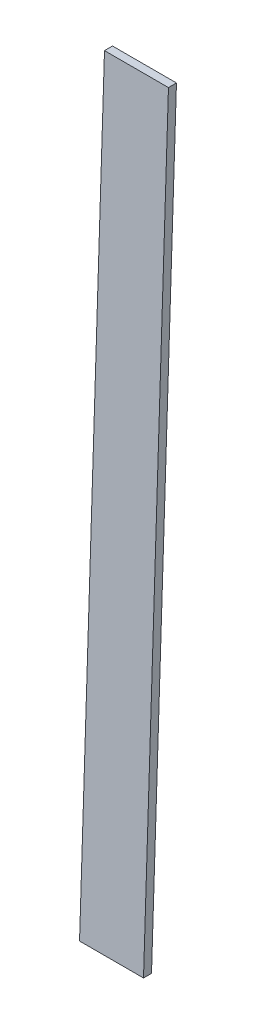
ISO-10303-21;
HEADER;
FILE_DESCRIPTION(('STEP AP214'),'2;1');
FILE_NAME('part.step','',(''),(''),'','','');
FILE_SCHEMA(('AUTOMOTIVE_DESIGN { 1 0 10303 214 1 1 1 1 }'));
ENDSEC;
DATA;
#1=APPLICATION_CONTEXT('core data for automotive mechanical design processes');
#2=APPLICATION_PROTOCOL_DEFINITION('international standard','automotive_design',2000,#1);
#3=PRODUCT_CONTEXT('',#1,'mechanical');
#4=PRODUCT('Part','Part','',(#3));
#5=PRODUCT_RELATED_PRODUCT_CATEGORY('part','',(#4));
#6=PRODUCT_DEFINITION_FORMATION('','',#4);
#7=PRODUCT_DEFINITION_CONTEXT('part definition',#1,'design');
#8=PRODUCT_DEFINITION('design','',#6,#7);
#9=PRODUCT_DEFINITION_SHAPE('','',#8);
#10=(LENGTH_UNIT() NAMED_UNIT(*) SI_UNIT(.MILLI.,.METRE.));
#11=(NAMED_UNIT(*) PLANE_ANGLE_UNIT() SI_UNIT($,.RADIAN.));
#12=(NAMED_UNIT(*) SI_UNIT($,.STERADIAN.) SOLID_ANGLE_UNIT());
#13=UNCERTAINTY_MEASURE_WITH_UNIT(LENGTH_MEASURE(1.E-05),#10,'distance_accuracy_value','');
#14=(GEOMETRIC_REPRESENTATION_CONTEXT(3) GLOBAL_UNCERTAINTY_ASSIGNED_CONTEXT((#13)) GLOBAL_UNIT_ASSIGNED_CONTEXT((#10,
#11,#12)) REPRESENTATION_CONTEXT('',''));
#15=CARTESIAN_POINT('',(0.,0.,0.));
#16=DIRECTION('',(0.,0.,1.));
#17=DIRECTION('',(1.,0.,0.));
#18=AXIS2_PLACEMENT_3D('',#15,#16,#17);
#19=CARTESIAN_POINT('',(0.,0.,0.));
#20=DIRECTION('',(0.,-1.,0.));
#21=DIRECTION('',(0.,0.,-1.));
#22=AXIS2_PLACEMENT_3D('',#19,#20,#21);
#23=PLANE('',#22);
#24=DIRECTION('',(0.,0.,1.));
#25=VECTOR('',#24,1.);
#26=CARTESIAN_POINT('',(0.,0.,0.));
#27=LINE('',#26,#25);
#28=CARTESIAN_POINT('',(0.,0.,-3.175));
#29=VERTEX_POINT('',#28);
#30=CARTESIAN_POINT('',(0.,0.,0.));
#31=VERTEX_POINT('',#30);
#32=EDGE_CURVE('E128',#29,#31,#27,.T.);
#33=ORIENTED_EDGE('',*,*,#32,.F.);
#34=DIRECTION('',(-1.,0.,0.));
#35=VECTOR('',#34,1.);
#36=CARTESIAN_POINT('',(0.,0.,-3.175));
#37=LINE('',#36,#35);
#38=CARTESIAN_POINT('',(25.4,0.,-3.175));
#39=VERTEX_POINT('',#38);
#40=EDGE_CURVE('E125',#39,#29,#37,.T.);
#41=ORIENTED_EDGE('',*,*,#40,.F.);
#42=DIRECTION('',(0.,0.,-1.));
#43=VECTOR('',#42,1.);
#44=CARTESIAN_POINT('',(25.4,0.,0.));
#45=LINE('',#44,#43);
#46=CARTESIAN_POINT('',(25.4,0.,0.));
#47=VERTEX_POINT('',#46);
#48=EDGE_CURVE('E58',#47,#39,#45,.T.);
#49=ORIENTED_EDGE('',*,*,#48,.F.);
#50=DIRECTION('',(1.,0.,0.));
#51=VECTOR('',#50,1.);
#52=CARTESIAN_POINT('',(0.,0.,0.));
#53=LINE('',#52,#51);
#54=EDGE_CURVE('E12',#31,#47,#53,.T.);
#55=ORIENTED_EDGE('',*,*,#54,.F.);
#56=EDGE_LOOP('',(#33,#41,#49,#55));
#57=FACE_BOUND('',#56,.T.);
#58=ADVANCED_FACE('F47',(#57),#23,.T.);
#59=CARTESIAN_POINT('',(0.,301.244,0.));
#60=DIRECTION('',(0.,1.,0.));
#61=DIRECTION('',(0.,0.,1.));
#62=AXIS2_PLACEMENT_3D('',#59,#60,#61);
#63=PLANE('',#62);
#64=DIRECTION('',(0.,0.,1.));
#65=VECTOR('',#64,1.);
#66=CARTESIAN_POINT('',(0.,301.244,-13.081));
#67=LINE('',#66,#65);
#68=CARTESIAN_POINT('',(0.,301.244,-13.081));
#69=VERTEX_POINT('',#68);
#70=CARTESIAN_POINT('',(0.,301.244,-9.906));
#71=VERTEX_POINT('',#70);
#72=EDGE_CURVE('E98',#69,#71,#67,.T.);
#73=ORIENTED_EDGE('',*,*,#72,.T.);
#74=DIRECTION('',(1.,0.,0.));
#75=VECTOR('',#74,1.);
#76=CARTESIAN_POINT('',(0.,301.244,-9.906));
#77=LINE('',#76,#75);
#78=CARTESIAN_POINT('',(25.4,301.244,-9.906));
#79=VERTEX_POINT('',#78);
#80=EDGE_CURVE('E119',#71,#79,#77,.T.);
#81=ORIENTED_EDGE('',*,*,#80,.T.);
#82=DIRECTION('',(0.,0.,-1.));
#83=VECTOR('',#82,1.);
#84=CARTESIAN_POINT('',(25.4,301.244,-13.081));
#85=LINE('',#84,#83);
#86=CARTESIAN_POINT('',(25.4,301.244,-13.081));
#87=VERTEX_POINT('',#86);
#88=EDGE_CURVE('E100',#79,#87,#85,.T.);
#89=ORIENTED_EDGE('',*,*,#88,.T.);
#90=DIRECTION('',(-1.,0.,0.));
#91=VECTOR('',#90,1.);
#92=CARTESIAN_POINT('',(0.,301.244,-13.081));
#93=LINE('',#92,#91);
#94=EDGE_CURVE('E93',#87,#69,#93,.T.);
#95=ORIENTED_EDGE('',*,*,#94,.T.);
#96=EDGE_LOOP('',(#73,#81,#89,#95));
#97=FACE_BOUND('',#96,.T.);
#98=ADVANCED_FACE('F96',(#97),#63,.T.);
#99=CARTESIAN_POINT('',(25.4,0.,0.));
#100=DIRECTION('',(1.,0.,0.));
#101=DIRECTION('',(0.,1.,0.));
#102=AXIS2_PLACEMENT_3D('',#99,#100,#101);
#103=PLANE('',#102);
#104=DIRECTION('',(0.,-0.999459771114519,0.0328658778022481));
#105=VECTOR('',#104,1.);
#106=CARTESIAN_POINT('',(25.4,301.244,-9.906));
#107=LINE('',#106,#105);
#108=EDGE_CURVE('E66',#79,#47,#107,.T.);
#109=ORIENTED_EDGE('',*,*,#108,.T.);
#110=ORIENTED_EDGE('',*,*,#48,.T.);
#111=DIRECTION('',(0.,-0.999459771114519,0.0328658778022481));
#112=VECTOR('',#111,1.);
#113=CARTESIAN_POINT('',(25.4,301.244,-13.081));
#114=LINE('',#113,#112);
#115=EDGE_CURVE('E133',#87,#39,#114,.T.);
#116=ORIENTED_EDGE('',*,*,#115,.F.);
#117=ORIENTED_EDGE('',*,*,#88,.F.);
#118=EDGE_LOOP('',(#109,#110,#116,#117));
#119=FACE_BOUND('',#118,.T.);
#120=ADVANCED_FACE('F147',(#119),#103,.T.);
#121=CARTESIAN_POINT('',(0.,-0.104292789590638,-3.17157047319222));
#122=DIRECTION('',(0.,-0.0328658778022481,-0.99945977111452));
#123=DIRECTION('',(0.,0.999459771114519,-0.0328658778022481));
#124=AXIS2_PLACEMENT_3D('',#121,#122,#123);
#125=PLANE('',#124);
#126=ORIENTED_EDGE('',*,*,#115,.T.);
#127=ORIENTED_EDGE('',*,*,#40,.T.);
#128=DIRECTION('',(0.,-0.999459771114519,0.0328658778022481));
#129=VECTOR('',#128,1.);
#130=CARTESIAN_POINT('',(0.,301.244,-13.081));
#131=LINE('',#130,#129);
#132=EDGE_CURVE('E115',#69,#29,#131,.T.);
#133=ORIENTED_EDGE('',*,*,#132,.F.);
#134=ORIENTED_EDGE('',*,*,#94,.F.);
#135=EDGE_LOOP('',(#126,#127,#133,#134));
#136=FACE_BOUND('',#135,.T.);
#137=ADVANCED_FACE('F123',(#136),#125,.T.);
#138=CARTESIAN_POINT('',(0.,0.,0.));
#139=DIRECTION('',(0.,0.0328658778022481,0.99945977111452));
#140=DIRECTION('',(0.,-0.999459771114519,0.0328658778022481));
#141=AXIS2_PLACEMENT_3D('',#138,#139,#140);
#142=PLANE('',#141);
#143=DIRECTION('',(0.,-0.999459771114519,0.0328658778022481));
#144=VECTOR('',#143,1.);
#145=CARTESIAN_POINT('',(0.,301.244,-9.906));
#146=LINE('',#145,#144);
#147=EDGE_CURVE('E117',#71,#31,#146,.T.);
#148=ORIENTED_EDGE('',*,*,#147,.T.);
#149=ORIENTED_EDGE('',*,*,#54,.T.);
#150=ORIENTED_EDGE('',*,*,#108,.F.);
#151=ORIENTED_EDGE('',*,*,#80,.F.);
#152=EDGE_LOOP('',(#148,#149,#150,#151));
#153=FACE_BOUND('',#152,.T.);
#154=ADVANCED_FACE('F231',(#153),#142,.T.);
#155=CARTESIAN_POINT('',(0.,0.,0.));
#156=DIRECTION('',(-1.,0.,0.));
#157=DIRECTION('',(0.,0.,1.));
#158=AXIS2_PLACEMENT_3D('',#155,#156,#157);
#159=PLANE('',#158);
#160=ORIENTED_EDGE('',*,*,#132,.T.);
#161=ORIENTED_EDGE('',*,*,#32,.T.);
#162=ORIENTED_EDGE('',*,*,#147,.F.);
#163=ORIENTED_EDGE('',*,*,#72,.F.);
#164=EDGE_LOOP('',(#160,#161,#162,#163));
#165=FACE_BOUND('',#164,.T.);
#166=ADVANCED_FACE('F114',(#165),#159,.T.);
#167=CLOSED_SHELL('',(#58,#98,#120,#137,#154,#166));
#168=MANIFOLD_SOLID_BREP('B2',#167);
#169=ADVANCED_BREP_SHAPE_REPRESENTATION('',(#18,#168),#14);
#170=SHAPE_DEFINITION_REPRESENTATION(#9,#169);
ENDSEC;
END-ISO-10303-21;
